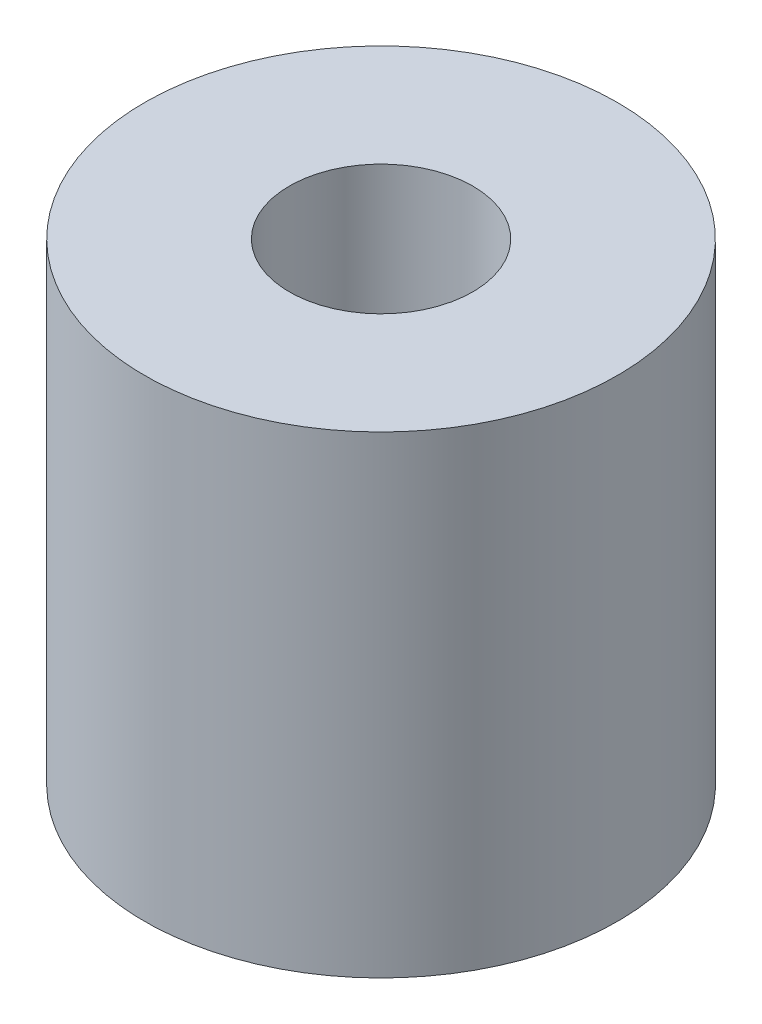
ISO-10303-21;
HEADER;
FILE_DESCRIPTION(('STEP AP214'),'2;1');
FILE_NAME('part.step','',(''),(''),'','','');
FILE_SCHEMA(('AUTOMOTIVE_DESIGN { 1 0 10303 214 1 1 1 1 }'));
ENDSEC;
DATA;
#1=APPLICATION_CONTEXT('core data for automotive mechanical design processes');
#2=APPLICATION_PROTOCOL_DEFINITION('international standard','automotive_design',2000,#1);
#3=PRODUCT_CONTEXT('',#1,'mechanical');
#4=PRODUCT('Part','Part','',(#3));
#5=PRODUCT_RELATED_PRODUCT_CATEGORY('part','',(#4));
#6=PRODUCT_DEFINITION_FORMATION('','',#4);
#7=PRODUCT_DEFINITION_CONTEXT('part definition',#1,'design');
#8=PRODUCT_DEFINITION('design','',#6,#7);
#9=PRODUCT_DEFINITION_SHAPE('','',#8);
#10=(LENGTH_UNIT() NAMED_UNIT(*) SI_UNIT(.MILLI.,.METRE.));
#11=(NAMED_UNIT(*) PLANE_ANGLE_UNIT() SI_UNIT($,.RADIAN.));
#12=(NAMED_UNIT(*) SI_UNIT($,.STERADIAN.) SOLID_ANGLE_UNIT());
#13=UNCERTAINTY_MEASURE_WITH_UNIT(LENGTH_MEASURE(1.E-05),#10,'distance_accuracy_value','');
#14=(GEOMETRIC_REPRESENTATION_CONTEXT(3) GLOBAL_UNCERTAINTY_ASSIGNED_CONTEXT((#13)) GLOBAL_UNIT_ASSIGNED_CONTEXT((#10,
#11,#12)) REPRESENTATION_CONTEXT('',''));
#15=CARTESIAN_POINT('',(0.,0.,0.));
#16=DIRECTION('',(0.,0.,1.));
#17=DIRECTION('',(1.,0.,0.));
#18=AXIS2_PLACEMENT_3D('',#15,#16,#17);
#19=CARTESIAN_POINT('',(0.,6.35,0.));
#20=DIRECTION('',(0.,-1.,0.));
#21=DIRECTION('',(0.,0.,-1.));
#22=AXIS2_PLACEMENT_3D('',#19,#20,#21);
#23=CYLINDRICAL_SURFACE('',#22,2.4638);
#24=CARTESIAN_POINT('',(0.,-6.35,0.));
#25=DIRECTION('',(0.,-1.,0.));
#26=DIRECTION('',(0.,0.,-1.));
#27=AXIS2_PLACEMENT_3D('',#24,#25,#26);
#28=CIRCLE('',#27,2.4638);
#29=CARTESIAN_POINT('',(0.,-6.35,-2.4638));
#30=VERTEX_POINT('',#29);
#31=EDGE_CURVE('E28',#30,#30,#28,.T.);
#32=ORIENTED_EDGE('',*,*,#31,.T.);
#33=EDGE_LOOP('',(#32));
#34=FACE_BOUND('',#33,.T.);
#35=CARTESIAN_POINT('',(0.,6.35,0.));
#36=DIRECTION('',(0.,-1.,0.));
#37=DIRECTION('',(0.,0.,-1.));
#38=AXIS2_PLACEMENT_3D('',#35,#36,#37);
#39=CIRCLE('',#38,2.4638);
#40=CARTESIAN_POINT('',(0.,6.35,-2.4638));
#41=VERTEX_POINT('',#40);
#42=EDGE_CURVE('E19',#41,#41,#39,.T.);
#43=ORIENTED_EDGE('',*,*,#42,.F.);
#44=EDGE_LOOP('',(#43));
#45=FACE_BOUND('',#44,.T.);
#46=ADVANCED_FACE('F16',(#34,#45),#23,.F.);
#47=CARTESIAN_POINT('',(0.,6.35,0.));
#48=DIRECTION('',(0.,1.,0.));
#49=DIRECTION('',(0.,0.,1.));
#50=AXIS2_PLACEMENT_3D('',#47,#48,#49);
#51=PLANE('',#50);
#52=ORIENTED_EDGE('',*,*,#42,.T.);
#53=EDGE_LOOP('',(#52));
#54=FACE_BOUND('',#53,.T.);
#55=CARTESIAN_POINT('',(0.,6.35,0.));
#56=DIRECTION('',(0.,-1.,0.));
#57=DIRECTION('',(0.,0.,-1.));
#58=AXIS2_PLACEMENT_3D('',#55,#56,#57);
#59=CIRCLE('',#58,6.35);
#60=CARTESIAN_POINT('',(0.,6.35,-6.35));
#61=VERTEX_POINT('',#60);
#62=EDGE_CURVE('E23',#61,#61,#59,.T.);
#63=ORIENTED_EDGE('',*,*,#62,.F.);
#64=EDGE_LOOP('',(#63));
#65=FACE_BOUND('',#64,.T.);
#66=ADVANCED_FACE('F36',(#54,#65),#51,.T.);
#67=CARTESIAN_POINT('',(0.,-6.35,0.));
#68=DIRECTION('',(0.,1.,0.));
#69=DIRECTION('',(0.,0.,1.));
#70=AXIS2_PLACEMENT_3D('',#67,#68,#69);
#71=PLANE('',#70);
#72=ORIENTED_EDGE('',*,*,#31,.F.);
#73=EDGE_LOOP('',(#72));
#74=FACE_BOUND('',#73,.T.);
#75=CARTESIAN_POINT('',(0.,-6.35,0.));
#76=DIRECTION('',(0.,-1.,0.));
#77=DIRECTION('',(0.,0.,-1.));
#78=AXIS2_PLACEMENT_3D('',#75,#76,#77);
#79=CIRCLE('',#78,6.35);
#80=CARTESIAN_POINT('',(0.,-6.35,-6.35));
#81=VERTEX_POINT('',#80);
#82=EDGE_CURVE('E10',#81,#81,#79,.F.);
#83=ORIENTED_EDGE('',*,*,#82,.F.);
#84=EDGE_LOOP('',(#83));
#85=FACE_BOUND('',#84,.T.);
#86=ADVANCED_FACE('F44',(#74,#85),#71,.F.);
#87=CARTESIAN_POINT('',(0.,6.35,0.));
#88=DIRECTION('',(0.,-1.,0.));
#89=DIRECTION('',(0.,0.,-1.));
#90=AXIS2_PLACEMENT_3D('',#87,#88,#89);
#91=CYLINDRICAL_SURFACE('',#90,6.35);
#92=ORIENTED_EDGE('',*,*,#62,.T.);
#93=EDGE_LOOP('',(#92));
#94=FACE_BOUND('',#93,.T.);
#95=ORIENTED_EDGE('',*,*,#82,.T.);
#96=EDGE_LOOP('',(#95));
#97=FACE_BOUND('',#96,.T.);
#98=ADVANCED_FACE('F45',(#94,#97),#91,.T.);
#99=CLOSED_SHELL('',(#46,#66,#86,#98));
#100=MANIFOLD_SOLID_BREP('B1',#99);
#101=ADVANCED_BREP_SHAPE_REPRESENTATION('',(#18,#100),#14);
#102=SHAPE_DEFINITION_REPRESENTATION(#9,#101);
ENDSEC;
END-ISO-10303-21;
